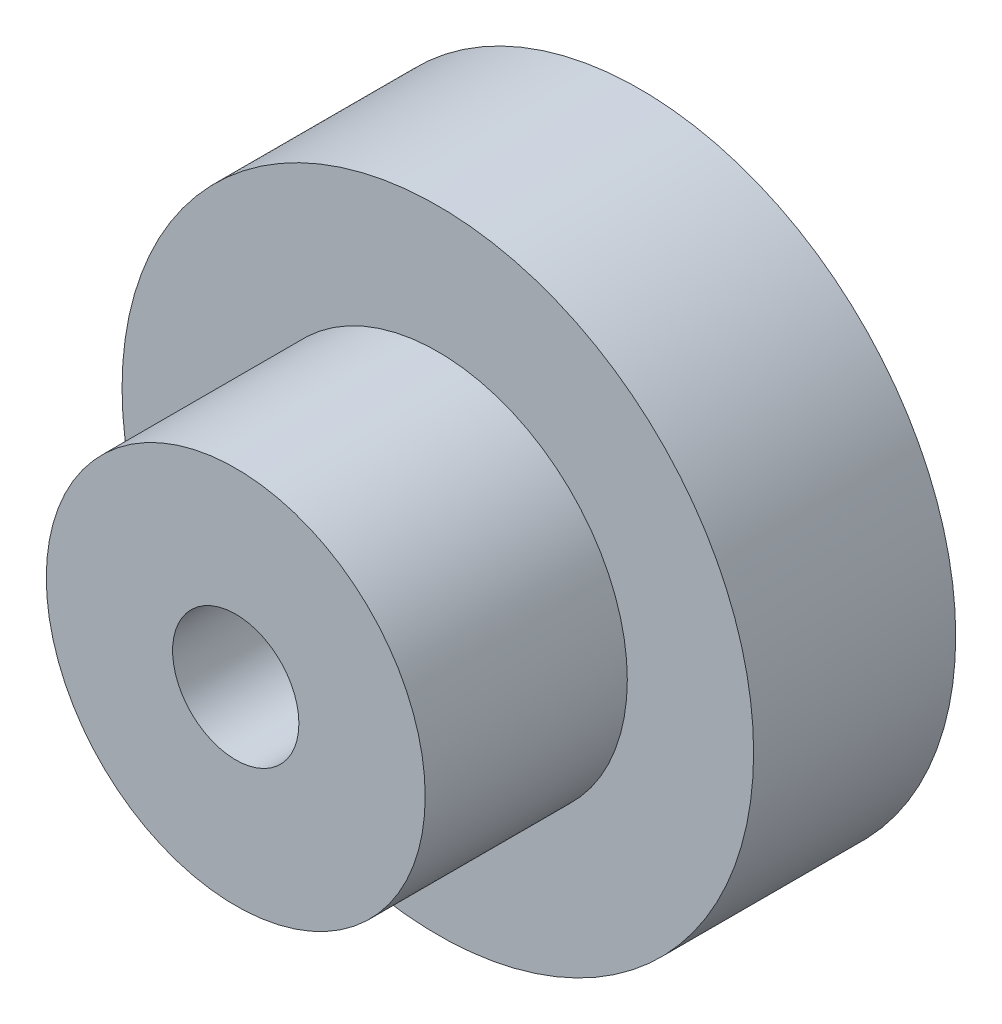
ISO-10303-21;
HEADER;
FILE_DESCRIPTION(('STEP AP214'),'2;1');
FILE_NAME('part.step','',(''),(''),'','','');
FILE_SCHEMA(('AUTOMOTIVE_DESIGN { 1 0 10303 214 1 1 1 1 }'));
ENDSEC;
DATA;
#1=APPLICATION_CONTEXT('core data for automotive mechanical design processes');
#2=APPLICATION_PROTOCOL_DEFINITION('international standard','automotive_design',2000,#1);
#3=PRODUCT_CONTEXT('',#1,'mechanical');
#4=PRODUCT('Part','Part','',(#3));
#5=PRODUCT_RELATED_PRODUCT_CATEGORY('part','',(#4));
#6=PRODUCT_DEFINITION_FORMATION('','',#4);
#7=PRODUCT_DEFINITION_CONTEXT('part definition',#1,'design');
#8=PRODUCT_DEFINITION('design','',#6,#7);
#9=PRODUCT_DEFINITION_SHAPE('','',#8);
#10=(LENGTH_UNIT() NAMED_UNIT(*) SI_UNIT(.MILLI.,.METRE.));
#11=(NAMED_UNIT(*) PLANE_ANGLE_UNIT() SI_UNIT($,.RADIAN.));
#12=(NAMED_UNIT(*) SI_UNIT($,.STERADIAN.) SOLID_ANGLE_UNIT());
#13=UNCERTAINTY_MEASURE_WITH_UNIT(LENGTH_MEASURE(1.E-05),#10,'distance_accuracy_value','');
#14=(GEOMETRIC_REPRESENTATION_CONTEXT(3) GLOBAL_UNCERTAINTY_ASSIGNED_CONTEXT((#13)) GLOBAL_UNIT_ASSIGNED_CONTEXT((#10,
#11,#12)) REPRESENTATION_CONTEXT('',''));
#15=CARTESIAN_POINT('',(0.,0.,0.));
#16=DIRECTION('',(0.,0.,1.));
#17=DIRECTION('',(1.,0.,0.));
#18=AXIS2_PLACEMENT_3D('',#15,#16,#17);
#19=CARTESIAN_POINT('',(0.,0.,8.));
#20=DIRECTION('',(0.,0.,1.));
#21=DIRECTION('',(1.,0.,0.));
#22=AXIS2_PLACEMENT_3D('',#19,#20,#21);
#23=PLANE('',#22);
#24=CARTESIAN_POINT('',(0.,0.,8.));
#25=DIRECTION('',(0.,0.,1.));
#26=DIRECTION('',(1.,0.,0.));
#27=AXIS2_PLACEMENT_3D('',#24,#25,#26);
#28=CIRCLE('',#27,12.5);
#29=CARTESIAN_POINT('',(12.5,0.,8.));
#30=VERTEX_POINT('',#29);
#31=EDGE_CURVE('E10',#30,#30,#28,.T.);
#32=ORIENTED_EDGE('',*,*,#31,.T.);
#33=EDGE_LOOP('',(#32));
#34=FACE_BOUND('',#33,.T.);
#35=CARTESIAN_POINT('',(0.,0.,8.));
#36=DIRECTION('',(0.,0.,1.));
#37=DIRECTION('',(1.,0.,0.));
#38=AXIS2_PLACEMENT_3D('',#35,#36,#37);
#39=CIRCLE('',#38,7.5);
#40=CARTESIAN_POINT('',(7.5,0.,8.));
#41=VERTEX_POINT('',#40);
#42=EDGE_CURVE('E54',#41,#41,#39,.T.);
#43=ORIENTED_EDGE('',*,*,#42,.F.);
#44=EDGE_LOOP('',(#43));
#45=FACE_BOUND('',#44,.T.);
#46=ADVANCED_FACE('F32',(#34,#45),#23,.T.);
#47=CARTESIAN_POINT('',(0.,0.,0.));
#48=DIRECTION('',(0.,0.,1.));
#49=DIRECTION('',(1.,0.,0.));
#50=AXIS2_PLACEMENT_3D('',#47,#48,#49);
#51=PLANE('',#50);
#52=CARTESIAN_POINT('',(0.,0.,0.));
#53=DIRECTION('',(0.,0.,1.));
#54=DIRECTION('',(1.,0.,0.));
#55=AXIS2_PLACEMENT_3D('',#52,#53,#54);
#56=CIRCLE('',#55,12.5);
#57=CARTESIAN_POINT('',(12.5,0.,0.));
#58=VERTEX_POINT('',#57);
#59=EDGE_CURVE('E44',#58,#58,#56,.T.);
#60=ORIENTED_EDGE('',*,*,#59,.F.);
#61=EDGE_LOOP('',(#60));
#62=FACE_BOUND('',#61,.T.);
#63=CARTESIAN_POINT('',(0.,0.,0.));
#64=DIRECTION('',(0.,0.,1.));
#65=DIRECTION('',(1.,0.,0.));
#66=AXIS2_PLACEMENT_3D('',#63,#64,#65);
#67=CIRCLE('',#66,2.5);
#68=CARTESIAN_POINT('',(2.5,0.,0.));
#69=VERTEX_POINT('',#68);
#70=EDGE_CURVE('E49',#69,#69,#67,.T.);
#71=ORIENTED_EDGE('',*,*,#70,.T.);
#72=EDGE_LOOP('',(#71));
#73=FACE_BOUND('',#72,.T.);
#74=ADVANCED_FACE('F88',(#62,#73),#51,.F.);
#75=CARTESIAN_POINT('',(0.,0.,8.));
#76=DIRECTION('',(0.,0.,-1.));
#77=DIRECTION('',(-1.,0.,0.));
#78=AXIS2_PLACEMENT_3D('',#75,#76,#77);
#79=CYLINDRICAL_SURFACE('',#78,12.5);
#80=ORIENTED_EDGE('',*,*,#31,.F.);
#81=EDGE_LOOP('',(#80));
#82=FACE_BOUND('',#81,.T.);
#83=ORIENTED_EDGE('',*,*,#59,.T.);
#84=EDGE_LOOP('',(#83));
#85=FACE_BOUND('',#84,.T.);
#86=ADVANCED_FACE('F34',(#82,#85),#79,.T.);
#87=CARTESIAN_POINT('',(0.,0.,8.));
#88=DIRECTION('',(0.,0.,-1.));
#89=DIRECTION('',(-1.,0.,0.));
#90=AXIS2_PLACEMENT_3D('',#87,#88,#89);
#91=CYLINDRICAL_SURFACE('',#90,2.5);
#92=CARTESIAN_POINT('',(-2.5,0.,12.5));
#93=CARTESIAN_POINT('',(-2.49999625789732,-0.0767298334620157,12.4999959089901));
#94=CARTESIAN_POINT('',(-2.4964290461501,-0.153582320644178,12.4940713290737));
#95=CARTESIAN_POINT('',(-2.48249903608568,-0.304975509530679,12.4706756804847));
#96=CARTESIAN_POINT('',(-2.47211948032719,-0.379510034596047,12.4531761381458));
#97=CARTESIAN_POINT('',(-2.44561558054488,-0.523751827790837,12.4076136388331));
#98=CARTESIAN_POINT('',(-2.42951973272944,-0.593481028226566,12.3796030418368));
#99=CARTESIAN_POINT('',(-2.39295367626407,-0.727030318214659,12.314139666859));
#100=CARTESIAN_POINT('',(-2.37248455380255,-0.790851869416383,12.2766892330313));
#101=CARTESIAN_POINT('',(-2.32705360719088,-0.916299278999315,12.1902251732914));
#102=CARTESIAN_POINT('',(-2.30186792195985,-0.977384020081416,12.1405463046486));
#103=CARTESIAN_POINT('',(-2.25030439279634,-1.09088270411891,12.0325327961717));
#104=CARTESIAN_POINT('',(-2.22392505153571,-1.14328534948112,11.9741870628127));
#105=CARTESIAN_POINT('',(-2.1691106699591,-1.24444996762974,11.8420764895033));
#106=CARTESIAN_POINT('',(-2.14082017703649,-1.29197766378809,11.7672982290187));
#107=CARTESIAN_POINT('',(-2.08938301412124,-1.37361437764896,11.6091534267569));
#108=CARTESIAN_POINT('',(-2.06622802273937,-1.4077451733516,11.5258011037524));
#109=CARTESIAN_POINT('',(-2.0335462966093,-1.45440601714222,11.3734035493468));
#110=CARTESIAN_POINT('',(-2.02207883137591,-1.47016197246827,11.3057640013897));
#111=CARTESIAN_POINT('',(-2.00590308295502,-1.49216172340475,11.1681962841696));
#112=CARTESIAN_POINT('',(-2.00118639643759,-1.49841734556836,11.0982710712455));
#113=CARTESIAN_POINT('',(-1.99920922463856,-1.50105508796009,10.9579885057827));
#114=CARTESIAN_POINT('',(-2.00196337012718,-1.49741783408419,10.8876305749068));
#115=CARTESIAN_POINT('',(-2.01453261443741,-1.48046060478828,10.7487212245724));
#116=CARTESIAN_POINT('',(-2.02435302432226,-1.46713334620103,10.6801712041526));
#117=CARTESIAN_POINT('',(-2.04953186944258,-1.43173921881793,10.5474697578719));
#118=CARTESIAN_POINT('',(-2.06481711652537,-1.40978748666087,10.4832729460755));
#119=CARTESIAN_POINT('',(-2.09927051350828,-1.35795061770837,10.3593050090719));
#120=CARTESIAN_POINT('',(-2.11844008623465,-1.32806257259705,10.2995355165761));
#121=CARTESIAN_POINT('',(-2.16255327268985,-1.25517983184583,10.1750159028772));
#122=CARTESIAN_POINT('',(-2.18792043372992,-1.21080724397723,10.1112219070451));
#123=CARTESIAN_POINT('',(-2.23930599764381,-1.11291092784003,9.99132351633298));
#124=CARTESIAN_POINT('',(-2.26532500262149,-1.05937845100579,9.93522656602349));
#125=CARTESIAN_POINT('',(-2.31935504958317,-0.935811834382969,9.82438701817824));
#126=CARTESIAN_POINT('',(-2.34713836268532,-0.86451768270496,9.77092269398401));
#127=CARTESIAN_POINT('',(-2.3977242843398,-0.712276050459003,9.67687795280209));
#128=CARTESIAN_POINT('',(-2.42052955425515,-0.631333763943566,9.63629064621004));
#129=CARTESIAN_POINT('',(-2.45730392066151,-0.467197585268208,9.5720678172041));
#130=CARTESIAN_POINT('',(-2.47173957439704,-0.384467624173582,9.54752464428408));
#131=CARTESIAN_POINT('',(-2.4921884281355,-0.215047895144642,9.51298880259462));
#132=CARTESIAN_POINT('',(-2.49821172952738,-0.128363005661321,9.50297868224642));
#133=CARTESIAN_POINT('',(-2.5009057037461,0.0337146143773942,9.49849215232168));
#134=CARTESIAN_POINT('',(-2.49873521714286,0.109042473418716,9.50209114491482));
#135=CARTESIAN_POINT('',(-2.48778712087048,0.257829401986059,9.52042585307192));
#136=CARTESIAN_POINT('',(-2.47900964518037,0.331288509376104,9.53516134280581));
#137=CARTESIAN_POINT('',(-2.4559479244219,0.472574932157611,9.57454343281246));
#138=CARTESIAN_POINT('',(-2.44180275662555,0.540495750928482,9.59894034907346));
#139=CARTESIAN_POINT('',(-2.40913880862845,0.671265749087262,9.65667737636526));
#140=CARTESIAN_POINT('',(-2.39061916586511,0.734113924963907,9.69001925134667));
#141=CARTESIAN_POINT('',(-2.3484549623736,0.860006262823863,9.7685569792087));
#142=CARTESIAN_POINT('',(-2.3244780273988,0.922394150456836,9.81462382907839));
#143=CARTESIAN_POINT('',(-2.27474265574732,1.03902603131014,9.91539139348861));
#144=CARTESIAN_POINT('',(-2.2489821658636,1.09326040273738,9.97010215485253));
#145=CARTESIAN_POINT('',(-2.19445423909891,1.19931996735579,10.0949103900371));
#146=CARTESIAN_POINT('',(-2.16573241746291,1.24991019630915,10.1660838854655));
#147=CARTESIAN_POINT('',(-2.1121618206671,1.33845238915668,10.3172160245682));
#148=CARTESIAN_POINT('',(-2.0873089799769,1.37641766769781,10.3971652938928));
#149=CARTESIAN_POINT('',(-2.04984909240519,1.43142578795777,10.5462430223067));
#150=CARTESIAN_POINT('',(-2.03575659328728,1.4512162533619,10.6139803123586));
#151=CARTESIAN_POINT('',(-2.01409605743544,1.48113663905972,10.7525320780801));
#152=CARTESIAN_POINT('',(-2.00651897642721,1.49127995297631,10.8233421443278));
#153=CARTESIAN_POINT('',(-1.99900446616267,1.50134130416631,10.966376947597));
#154=CARTESIAN_POINT('',(-1.99909576445937,1.50122089107869,11.038605990687));
#155=CARTESIAN_POINT('',(-2.0069771789285,1.49066472959328,11.1818944356095));
#156=CARTESIAN_POINT('',(-2.0147714813882,1.48022337215759,11.2529531800806));
#157=CARTESIAN_POINT('',(-2.0363318524298,1.45040174148913,11.3884884175722));
#158=CARTESIAN_POINT('',(-2.0497921180558,1.43147636845352,11.4531170943069));
#159=CARTESIAN_POINT('',(-2.08105501960151,1.38563242076994,11.5783372544742));
#160=CARTESIAN_POINT('',(-2.09885929040482,1.3587108358848,11.6389272069605));
#161=CARTESIAN_POINT('',(-2.14012990550916,1.29289245555733,11.7643198572208));
#162=CARTESIAN_POINT('',(-2.16404587582639,1.25279167675753,11.8283411038543));
#163=CARTESIAN_POINT('',(-2.21320127030767,1.16375698389085,11.9493800726173));
#164=CARTESIAN_POINT('',(-2.23844177205021,1.11481579607799,12.0063919621526));
#165=CARTESIAN_POINT('',(-2.29225690291476,1.00009777425734,12.1213509491317));
#166=CARTESIAN_POINT('',(-2.32070308663658,0.932876819313909,12.1779310748962));
#167=CARTESIAN_POINT('',(-2.37365428872367,0.788462434445594,12.2790978558633));
#168=CARTESIAN_POINT('',(-2.39815789310936,0.711265444501544,12.3236802119848));
#169=CARTESIAN_POINT('',(-2.43985578654394,0.551125230801458,12.3977858075737));
#170=CARTESIAN_POINT('',(-2.45725077479787,0.468430086957218,12.4277280649268));
#171=CARTESIAN_POINT('',(-2.48366273001246,0.297973306118812,12.472724695211));
#172=CARTESIAN_POINT('',(-2.49271125871485,0.210232099648617,12.487835167857));
#173=CARTESIAN_POINT('',(-2.49802001168187,0.10155809691754,12.4966974547087));
#174=CARTESIAN_POINT('',(-2.49876114656362,0.08127625902828,12.4979344173061));
#175=CARTESIAN_POINT('',(-2.49975164517367,0.0406658206871133,12.4995862463709));
#176=CARTESIAN_POINT('',(-2.50000099184316,0.0203372186375699,12.5000010843209));
#177=CARTESIAN_POINT('',(-2.5,0.,12.5));
#178=B_SPLINE_CURVE_WITH_KNOTS('',3,(#92,#93,#94,#95,#96,#97,#98,#99,#100,#101,#102,#103,#104,
#105,#106,#107,#108,#109,#110,#111,#112,#113,#114,#115,#116,#117,#118,#119,#120,#121,#122,#123,
#124,#125,#126,#127,#128,#129,#130,#131,#132,#133,#134,#135,#136,#137,#138,#139,#140,#141,#142,
#143,#144,#145,#146,#147,#148,#149,#150,#151,#152,#153,#154,#155,#156,#157,#158,#159,#160,#161,
#162,#163,#164,#165,#166,#167,#168,#169,#170,#171,#172,#173,#174,#175,#176,#177),.UNSPECIFIED.,
.T.,.F.,(4,2,2,2,2,2,2,2,2,2,2,2,2,2,2,2,2,2,2,2,2,2,2,2,2,2,2,2,2,2,2,2,2,2,2,2,2,2,2,2,2,2,4),
(0.,0.230102237548649,0.460772627520012,0.690308884600012,0.919788197992275,1.16681590732473,
1.41416257934801,1.69183813189807,1.96906040692092,2.17933829855634,2.38935420916578,
2.59978170870726,2.81036753273873,3.01823267593207,3.22617409809869,3.47046995225163,
3.71500044803674,3.99360957884691,4.27206939275325,4.5329679069656,4.79355286918236,
5.01875602722427,5.24395461863456,5.46367785689772,5.68344445659026,5.92601365818362,
6.16886690081837,6.4433676242801,6.71757792616456,6.93257787314693,7.14727888733319,
7.36278425777433,7.57840681155725,7.78364098331142,7.98895251523035,8.22578610052286,
8.46281544370208,8.73854311775519,9.01436946031986,9.28175654462678,9.54812832184449,
9.60911473335178,9.67010326027642),.UNSPECIFIED.);
#179=CARTESIAN_POINT('',(-2.5,0.,12.5));
#180=VERTEX_POINT('',#179);
#181=EDGE_CURVE('E62',#180,#180,#178,.T.);
#182=ORIENTED_EDGE('',*,*,#181,.F.);
#183=EDGE_LOOP('',(#182));
#184=FACE_BOUND('',#183,.T.);
#185=ORIENTED_EDGE('',*,*,#70,.F.);
#186=EDGE_LOOP('',(#185));
#187=FACE_BOUND('',#186,.T.);
#188=CARTESIAN_POINT('',(0.,0.,16.));
#189=DIRECTION('',(0.,0.,1.));
#190=DIRECTION('',(1.,0.,0.));
#191=AXIS2_PLACEMENT_3D('',#188,#189,#190);
#192=CIRCLE('',#191,2.5);
#193=CARTESIAN_POINT('',(2.5,0.,16.));
#194=VERTEX_POINT('',#193);
#195=EDGE_CURVE('E57',#194,#194,#192,.T.);
#196=ORIENTED_EDGE('',*,*,#195,.T.);
#197=EDGE_LOOP('',(#196));
#198=FACE_BOUND('',#197,.T.);
#199=ADVANCED_FACE('F67',(#184,#187,#198),#91,.F.);
#200=CARTESIAN_POINT('',(0.,0.,16.));
#201=DIRECTION('',(0.,0.,1.));
#202=DIRECTION('',(1.,0.,0.));
#203=AXIS2_PLACEMENT_3D('',#200,#201,#202);
#204=PLANE('',#203);
#205=CARTESIAN_POINT('',(0.,0.,16.));
#206=DIRECTION('',(0.,0.,1.));
#207=DIRECTION('',(1.,0.,0.));
#208=AXIS2_PLACEMENT_3D('',#205,#206,#207);
#209=CIRCLE('',#208,7.5);
#210=CARTESIAN_POINT('',(7.5,0.,16.));
#211=VERTEX_POINT('',#210);
#212=EDGE_CURVE('E53',#211,#211,#209,.T.);
#213=ORIENTED_EDGE('',*,*,#212,.T.);
#214=EDGE_LOOP('',(#213));
#215=FACE_BOUND('',#214,.T.);
#216=ORIENTED_EDGE('',*,*,#195,.F.);
#217=EDGE_LOOP('',(#216));
#218=FACE_BOUND('',#217,.T.);
#219=ADVANCED_FACE('F76',(#215,#218),#204,.T.);
#220=CARTESIAN_POINT('',(0.,0.,16.));
#221=DIRECTION('',(0.,0.,-1.));
#222=DIRECTION('',(-1.,0.,0.));
#223=AXIS2_PLACEMENT_3D('',#220,#221,#222);
#224=CYLINDRICAL_SURFACE('',#223,7.5);
#225=CARTESIAN_POINT('',(-7.5,0.,12.5));
#226=CARTESIAN_POINT('',(-7.49999846371307,-0.0833653601889498,12.4999969332525));
#227=CARTESIAN_POINT('',(-7.49859577767346,-0.166769490302283,12.4930267355485));
#228=CARTESIAN_POINT('',(-7.49313548434847,-0.331220261533529,12.4653522498271));
#229=CARTESIAN_POINT('',(-7.48907576790279,-0.412264976312034,12.4446370507977));
#230=CARTESIAN_POINT('',(-7.4787547391743,-0.56959545789497,12.3901380895688));
#231=CARTESIAN_POINT('',(-7.47249553615077,-0.645885701899702,12.356366844733));
#232=CARTESIAN_POINT('',(-7.45845597052971,-0.791711983296339,12.2767516287331));
#233=CARTESIAN_POINT('',(-7.4506756985356,-0.861248422613718,12.2309083765892));
#234=CARTESIAN_POINT('',(-7.43433247994955,-0.992540215972298,12.1277922585628));
#235=CARTESIAN_POINT('',(-7.42576118256521,-1.05419092673779,12.0703874669132));
#236=CARTESIAN_POINT('',(-7.40886270678882,-1.16705513491204,11.9460613754124));
#237=CARTESIAN_POINT('',(-7.40053554750636,-1.21826781715564,11.8791393329973));
#238=CARTESIAN_POINT('',(-7.38498662718923,-1.30924763002143,11.7369257104822));
#239=CARTESIAN_POINT('',(-7.37777561047419,-1.3489064082988,11.6615635343055));
#240=CARTESIAN_POINT('',(-7.36539402087627,-1.41495849987046,11.5050772714939));
#241=CARTESIAN_POINT('',(-7.36022324642942,-1.44135312365586,11.4239537549805));
#242=CARTESIAN_POINT('',(-7.35259207878307,-1.47978794982724,11.2593734541381));
#243=CARTESIAN_POINT('',(-7.35009705160781,-1.49201174693817,11.1759611837867));
#244=CARTESIAN_POINT('',(-7.34799562590941,-1.50232819158918,11.0082352679535));
#245=CARTESIAN_POINT('',(-7.34838893201761,-1.50042228407025,10.9239217155198));
#246=CARTESIAN_POINT('',(-7.35198826722277,-1.48268185965273,10.7581298179685));
#247=CARTESIAN_POINT('',(-7.35515179288145,-1.46705781036586,10.676627891559));
#248=CARTESIAN_POINT('',(-7.36386819240002,-1.42265682693458,10.5174258850055));
#249=CARTESIAN_POINT('',(-7.36942118036668,-1.39387926465102,10.4397259866215));
#250=CARTESIAN_POINT('',(-7.38233427750612,-1.32378717551208,10.2897271074446));
#251=CARTESIAN_POINT('',(-7.38970634720557,-1.28238922684817,10.2174681806462));
#252=CARTESIAN_POINT('',(-7.40541928159593,-1.18829036185902,10.0808437250408));
#253=CARTESIAN_POINT('',(-7.41376025757549,-1.13558814653525,10.0164791047233));
#254=CARTESIAN_POINT('',(-7.43065531862193,-1.01924990184088,9.89625589631459));
#255=CARTESIAN_POINT('',(-7.43921053816357,-0.95543424181867,9.8405711482113));
#256=CARTESIAN_POINT('',(-7.45543273071613,-0.819277536093017,9.74066923054816));
#257=CARTESIAN_POINT('',(-7.4630996923346,-0.746936381069086,9.69645220805963));
#258=CARTESIAN_POINT('',(-7.47670035241331,-0.595589080318383,9.62070873616103));
#259=CARTESIAN_POINT('',(-7.48263133272408,-0.516572729377951,9.58920215953319));
#260=CARTESIAN_POINT('',(-7.49207113481787,-0.354223464672998,9.53995928894214));
#261=CARTESIAN_POINT('',(-7.49558025000797,-0.270891075108675,9.52222132688955));
#262=CARTESIAN_POINT('',(-7.49974007800301,-0.103769108440726,9.50126531930858));
#263=CARTESIAN_POINT('',(-7.50043761978705,-0.020010492488365,9.49780937068959));
#264=CARTESIAN_POINT('',(-7.49902577895154,0.146887401289071,9.50487478841327));
#265=CARTESIAN_POINT('',(-7.49691655412169,0.23002671366569,9.51539536902889));
#266=CARTESIAN_POINT('',(-7.49015748012026,0.392558489919811,9.54991756031593));
#267=CARTESIAN_POINT('',(-7.4855306460631,0.471977922509854,9.57379710274685));
#268=CARTESIAN_POINT('',(-7.47425328091549,0.625685441249501,9.63422597398371));
#269=CARTESIAN_POINT('',(-7.4676025982134,0.69997314245631,9.67077625201524));
#270=CARTESIAN_POINT('',(-7.45289867299942,0.842311760529327,9.75602373597696));
#271=CARTESIAN_POINT('',(-7.44482925655578,0.910275190128282,9.80486417155842));
#272=CARTESIAN_POINT('',(-7.42822102244824,1.03712702867881,9.91311378681092));
#273=CARTESIAN_POINT('',(-7.41968215452582,1.09601446339614,9.9725240995998));
#274=CARTESIAN_POINT('',(-7.40293955335447,1.20396088616126,10.1013100278367));
#275=CARTESIAN_POINT('',(-7.39474290349956,1.25285655367298,10.170823616332));
#276=CARTESIAN_POINT('',(-7.37976287694291,1.33827813007681,10.317217042035));
#277=CARTESIAN_POINT('',(-7.37297944370014,1.37480453388436,10.3940965843603));
#278=CARTESIAN_POINT('',(-7.36165110876574,1.43422776237294,10.5526523692243));
#279=CARTESIAN_POINT('',(-7.3570946230828,1.45719524968658,10.6343012618155));
#280=CARTESIAN_POINT('',(-7.35071155188038,1.4890629774408,10.8004001802364));
#281=CARTESIAN_POINT('',(-7.34888461036667,1.49796505233767,10.884849839314));
#282=CARTESIAN_POINT('',(-7.34818724447069,1.5013813663012,11.0525132968165));
#283=CARTESIAN_POINT('',(-7.34926378783951,1.49615368210635,11.1357217233905));
#284=CARTESIAN_POINT('',(-7.35413360226921,1.47202845615009,11.3000474748575));
#285=CARTESIAN_POINT('',(-7.35792685150754,1.45313102419395,11.3811648165422));
#286=CARTESIAN_POINT('',(-7.36777896328738,1.40231785274843,11.5388415668608));
#287=CARTESIAN_POINT('',(-7.37383231528246,1.37043376007602,11.6154115407536));
#288=CARTESIAN_POINT('',(-7.38752572461255,1.29458196690241,11.7621555811017));
#289=CARTESIAN_POINT('',(-7.39516591498341,1.25061325316233,11.8323291105877));
#290=CARTESIAN_POINT('',(-7.41133440784838,1.15095887217962,11.9655733582255));
#291=CARTESIAN_POINT('',(-7.41987559364549,1.09508683085277,12.0285031479014));
#292=CARTESIAN_POINT('',(-7.43679122807932,0.973596553519713,12.1441793082938));
#293=CARTESIAN_POINT('',(-7.44516563794777,0.907976080730005,12.1969233354759));
#294=CARTESIAN_POINT('',(-7.46090748581957,0.768026443632372,12.2912519659197));
#295=CARTESIAN_POINT('',(-7.46826346828869,0.693613326644755,12.33271400492));
#296=CARTESIAN_POINT('',(-7.481026876275,0.538749541411101,12.4024791838949));
#297=CARTESIAN_POINT('',(-7.48643605707924,0.458304391294691,12.4307941842987));
#298=CARTESIAN_POINT('',(-7.49364558893056,0.31473223338567,12.4679779220671));
#299=CARTESIAN_POINT('',(-7.49601454737677,0.252422496020677,12.4799647905616));
#300=CARTESIAN_POINT('',(-7.49919231209839,0.1267492878151,12.4959768685375));
#301=CARTESIAN_POINT('',(-7.50000116809732,0.0633858506229284,12.5000023317647));
#302=CARTESIAN_POINT('',(-7.5,0.,12.5));
#303=B_SPLINE_CURVE_WITH_KNOTS('',3,(#225,#226,#227,#228,#229,#230,#231,#232,#233,#234,#235,
#236,#237,#238,#239,#240,#241,#242,#243,#244,#245,#246,#247,#248,#249,#250,#251,#252,#253,#254,
#255,#256,#257,#258,#259,#260,#261,#262,#263,#264,#265,#266,#267,#268,#269,#270,#271,#272,#273,
#274,#275,#276,#277,#278,#279,#280,#281,#282,#283,#284,#285,#286,#287,#288,#289,#290,#291,#292,
#293,#294,#295,#296,#297,#298,#299,#300,#301,#302),.UNSPECIFIED.,.T.,.F.,(4,2,2,2,2,2,2,2,2,2,2,
2,2,2,2,2,2,2,2,2,2,2,2,2,2,2,2,2,2,2,2,2,2,2,2,2,2,2,4),(0.,0.249864195991888,
0.499926976036985,0.749750602875513,0.999559353346296,1.25239900516828,1.50525839512105,
1.76041792508884,2.01555224047796,2.26734277655381,2.51910756421838,2.76707590509418,
3.01505608880595,3.26471235305389,3.51439732124506,3.76857378737026,4.02275351309731,
4.27732912281036,4.53187388547055,4.78216103514398,5.03243411486802,5.28045680926086,
5.52849808824034,5.77957599050039,6.03068082518896,6.2856094286884,6.54052783085201,
6.79410571549086,7.04765052495623,7.29659583851553,7.54553915238914,7.79387941879666,
8.04224051372801,8.29482114358716,8.54745981799397,8.80274245013457,9.05779433276279,
9.24778162934842,9.43776287056496),.UNSPECIFIED.);
#304=CARTESIAN_POINT('',(-7.5,0.,12.5));
#305=VERTEX_POINT('',#304);
#306=EDGE_CURVE('E36',#305,#305,#303,.T.);
#307=ORIENTED_EDGE('',*,*,#306,.T.);
#308=EDGE_LOOP('',(#307));
#309=FACE_BOUND('',#308,.T.);
#310=ORIENTED_EDGE('',*,*,#212,.F.);
#311=EDGE_LOOP('',(#310));
#312=FACE_BOUND('',#311,.T.);
#313=ORIENTED_EDGE('',*,*,#42,.T.);
#314=EDGE_LOOP('',(#313));
#315=FACE_BOUND('',#314,.T.);
#316=ADVANCED_FACE('F74',(#309,#312,#315),#224,.T.);
#317=CARTESIAN_POINT('',(-10.,0.,11.));
#318=DIRECTION('',(1.,0.,0.));
#319=DIRECTION('',(0.,0.,-1.));
#320=AXIS2_PLACEMENT_3D('',#317,#318,#319);
#321=CYLINDRICAL_SURFACE('',#320,1.5);
#322=ORIENTED_EDGE('',*,*,#181,.T.);
#323=EDGE_LOOP('',(#322));
#324=FACE_BOUND('',#323,.T.);
#325=ORIENTED_EDGE('',*,*,#306,.F.);
#326=EDGE_LOOP('',(#325));
#327=FACE_BOUND('',#326,.T.);
#328=ADVANCED_FACE('F70',(#324,#327),#321,.F.);
#329=CLOSED_SHELL('',(#46,#74,#86,#199,#219,#316,#328));
#330=MANIFOLD_SOLID_BREP('B2',#329);
#331=ADVANCED_BREP_SHAPE_REPRESENTATION('',(#18,#330),#14);
#332=SHAPE_DEFINITION_REPRESENTATION(#9,#331);
ENDSEC;
END-ISO-10303-21;
